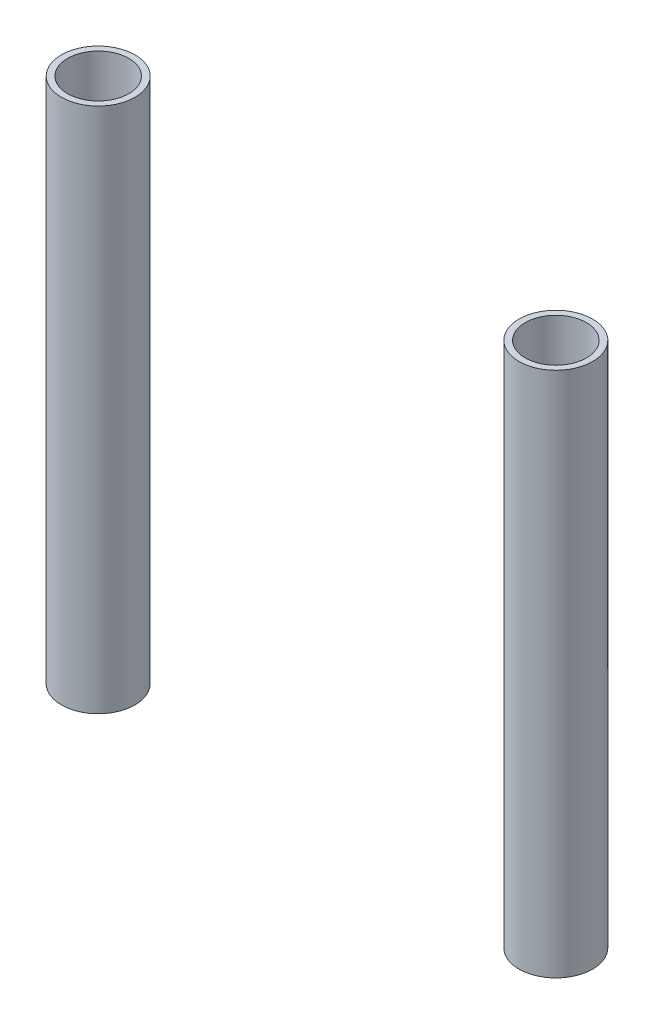
ISO-10303-21;
HEADER;
FILE_DESCRIPTION(('STEP AP214'),'2;1');
FILE_NAME('part.step','',(''),(''),'','','');
FILE_SCHEMA(('AUTOMOTIVE_DESIGN { 1 0 10303 214 1 1 1 1 }'));
ENDSEC;
DATA;
#1=APPLICATION_CONTEXT('core data for automotive mechanical design processes');
#2=APPLICATION_PROTOCOL_DEFINITION('international standard','automotive_design',2000,#1);
#3=PRODUCT_CONTEXT('',#1,'mechanical');
#4=PRODUCT('Part','Part','',(#3));
#5=PRODUCT_RELATED_PRODUCT_CATEGORY('part','',(#4));
#6=PRODUCT_DEFINITION_FORMATION('','',#4);
#7=PRODUCT_DEFINITION_CONTEXT('part definition',#1,'design');
#8=PRODUCT_DEFINITION('design','',#6,#7);
#9=PRODUCT_DEFINITION_SHAPE('','',#8);
#10=(LENGTH_UNIT() NAMED_UNIT(*) SI_UNIT(.MILLI.,.METRE.));
#11=(NAMED_UNIT(*) PLANE_ANGLE_UNIT() SI_UNIT($,.RADIAN.));
#12=(NAMED_UNIT(*) SI_UNIT($,.STERADIAN.) SOLID_ANGLE_UNIT());
#13=UNCERTAINTY_MEASURE_WITH_UNIT(LENGTH_MEASURE(1.E-05),#10,'distance_accuracy_value','');
#14=(GEOMETRIC_REPRESENTATION_CONTEXT(3) GLOBAL_UNCERTAINTY_ASSIGNED_CONTEXT((#13)) GLOBAL_UNIT_ASSIGNED_CONTEXT((#10,
#11,#12)) REPRESENTATION_CONTEXT('',''));
#15=CARTESIAN_POINT('',(0.,0.,0.));
#16=DIRECTION('',(0.,0.,1.));
#17=DIRECTION('',(1.,0.,0.));
#18=AXIS2_PLACEMENT_3D('',#15,#16,#17);
#19=CARTESIAN_POINT('',(50.,115.,0.));
#20=DIRECTION('',(0.,-1.,0.));
#21=DIRECTION('',(0.,0.,-1.));
#22=AXIS2_PLACEMENT_3D('',#19,#20,#21);
#23=PLANE('',#22);
#24=CARTESIAN_POINT('',(50.,115.,0.));
#25=DIRECTION('',(0.,1.,0.));
#26=DIRECTION('',(0.,0.,-1.));
#27=AXIS2_PLACEMENT_3D('',#24,#25,#26);
#28=CIRCLE('',#27,8.03897815940427);
#29=CARTESIAN_POINT('',(50.,115.,-8.03897815940426));
#30=VERTEX_POINT('',#29);
#31=EDGE_CURVE('E11',#30,#30,#28,.T.);
#32=ORIENTED_EDGE('',*,*,#31,.T.);
#33=EDGE_LOOP('',(#32));
#34=FACE_BOUND('',#33,.T.);
#35=CARTESIAN_POINT('',(50.,115.,0.));
#36=DIRECTION('',(0.,1.,0.));
#37=DIRECTION('',(0.,0.,-1.));
#38=AXIS2_PLACEMENT_3D('',#35,#36,#37);
#39=CIRCLE('',#38,6.69277815940427);
#40=CARTESIAN_POINT('',(50.,115.,-6.69277815940426));
#41=VERTEX_POINT('',#40);
#42=EDGE_CURVE('E50',#41,#41,#39,.T.);
#43=ORIENTED_EDGE('',*,*,#42,.F.);
#44=EDGE_LOOP('',(#43));
#45=FACE_BOUND('',#44,.T.);
#46=ADVANCED_FACE('F39',(#34,#45),#23,.F.);
#47=CARTESIAN_POINT('',(50.,0.,0.));
#48=DIRECTION('',(0.,-1.,0.));
#49=DIRECTION('',(0.,0.,-1.));
#50=AXIS2_PLACEMENT_3D('',#47,#48,#49);
#51=PLANE('',#50);
#52=CARTESIAN_POINT('',(50.,0.,0.));
#53=DIRECTION('',(0.,1.,0.));
#54=DIRECTION('',(0.,0.,-1.));
#55=AXIS2_PLACEMENT_3D('',#52,#53,#54);
#56=CIRCLE('',#55,8.03897815940427);
#57=CARTESIAN_POINT('',(50.,0.,-8.03897815940426));
#58=VERTEX_POINT('',#57);
#59=EDGE_CURVE('E43',#58,#58,#56,.T.);
#60=ORIENTED_EDGE('',*,*,#59,.F.);
#61=EDGE_LOOP('',(#60));
#62=FACE_BOUND('',#61,.T.);
#63=CARTESIAN_POINT('',(50.,0.,0.));
#64=DIRECTION('',(0.,1.,0.));
#65=DIRECTION('',(0.,0.,-1.));
#66=AXIS2_PLACEMENT_3D('',#63,#64,#65);
#67=CIRCLE('',#66,6.69277815940427);
#68=CARTESIAN_POINT('',(50.,0.,-6.69277815940426));
#69=VERTEX_POINT('',#68);
#70=EDGE_CURVE('E52',#69,#69,#67,.T.);
#71=ORIENTED_EDGE('',*,*,#70,.T.);
#72=EDGE_LOOP('',(#71));
#73=FACE_BOUND('',#72,.T.);
#74=ADVANCED_FACE('F62',(#62,#73),#51,.T.);
#75=CARTESIAN_POINT('',(50.,115.,0.));
#76=DIRECTION('',(0.,-1.,0.));
#77=DIRECTION('',(0.,0.,-1.));
#78=AXIS2_PLACEMENT_3D('',#75,#76,#77);
#79=CYLINDRICAL_SURFACE('',#78,8.03897815940427);
#80=ORIENTED_EDGE('',*,*,#31,.F.);
#81=EDGE_LOOP('',(#80));
#82=FACE_BOUND('',#81,.T.);
#83=ORIENTED_EDGE('',*,*,#59,.T.);
#84=EDGE_LOOP('',(#83));
#85=FACE_BOUND('',#84,.T.);
#86=ADVANCED_FACE('F41',(#82,#85),#79,.T.);
#87=CARTESIAN_POINT('',(50.,115.,0.));
#88=DIRECTION('',(0.,-1.,0.));
#89=DIRECTION('',(0.,0.,-1.));
#90=AXIS2_PLACEMENT_3D('',#87,#88,#89);
#91=CYLINDRICAL_SURFACE('',#90,6.69277815940427);
#92=ORIENTED_EDGE('',*,*,#42,.T.);
#93=EDGE_LOOP('',(#92));
#94=FACE_BOUND('',#93,.T.);
#95=ORIENTED_EDGE('',*,*,#70,.F.);
#96=EDGE_LOOP('',(#95));
#97=FACE_BOUND('',#96,.T.);
#98=ADVANCED_FACE('F58',(#94,#97),#91,.F.);
#99=CLOSED_SHELL('',(#46,#74,#86,#98));
#100=MANIFOLD_SOLID_BREP('B2',#99);
#101=CARTESIAN_POINT('',(-50.,115.,0.));
#102=DIRECTION('',(0.,1.,0.));
#103=DIRECTION('',(0.,0.,1.));
#104=AXIS2_PLACEMENT_3D('',#101,#102,#103);
#105=PLANE('',#104);
#106=CARTESIAN_POINT('',(-50.,115.,0.));
#107=DIRECTION('',(0.,1.,0.));
#108=DIRECTION('',(0.,0.,1.));
#109=AXIS2_PLACEMENT_3D('',#106,#107,#108);
#110=CIRCLE('',#109,8.03897815940428);
#111=CARTESIAN_POINT('',(-50.,115.,8.03897815940429));
#112=VERTEX_POINT('',#111);
#113=EDGE_CURVE('E38',#112,#112,#110,.T.);
#114=ORIENTED_EDGE('',*,*,#113,.T.);
#115=EDGE_LOOP('',(#114));
#116=FACE_BOUND('',#115,.T.);
#117=CARTESIAN_POINT('',(-50.,115.,0.));
#118=DIRECTION('',(0.,1.,0.));
#119=DIRECTION('',(0.,0.,1.));
#120=AXIS2_PLACEMENT_3D('',#117,#118,#119);
#121=CIRCLE('',#120,6.69277815940428);
#122=CARTESIAN_POINT('',(-50.,115.,6.69277815940429));
#123=VERTEX_POINT('',#122);
#124=EDGE_CURVE('E112',#123,#123,#121,.T.);
#125=ORIENTED_EDGE('',*,*,#124,.F.);
#126=EDGE_LOOP('',(#125));
#127=FACE_BOUND('',#126,.T.);
#128=ADVANCED_FACE('F101',(#116,#127),#105,.T.);
#129=CARTESIAN_POINT('',(-50.,0.,0.));
#130=DIRECTION('',(0.,1.,0.));
#131=DIRECTION('',(0.,0.,1.));
#132=AXIS2_PLACEMENT_3D('',#129,#130,#131);
#133=PLANE('',#132);
#134=CARTESIAN_POINT('',(-50.,0.,0.));
#135=DIRECTION('',(0.,1.,0.));
#136=DIRECTION('',(0.,0.,1.));
#137=AXIS2_PLACEMENT_3D('',#134,#135,#136);
#138=CIRCLE('',#137,8.03897815940428);
#139=CARTESIAN_POINT('',(-50.,0.,8.03897815940429));
#140=VERTEX_POINT('',#139);
#141=EDGE_CURVE('E105',#140,#140,#138,.T.);
#142=ORIENTED_EDGE('',*,*,#141,.F.);
#143=EDGE_LOOP('',(#142));
#144=FACE_BOUND('',#143,.T.);
#145=CARTESIAN_POINT('',(-50.,0.,0.));
#146=DIRECTION('',(0.,1.,0.));
#147=DIRECTION('',(0.,0.,1.));
#148=AXIS2_PLACEMENT_3D('',#145,#146,#147);
#149=CIRCLE('',#148,6.69277815940428);
#150=CARTESIAN_POINT('',(-50.,0.,6.69277815940429));
#151=VERTEX_POINT('',#150);
#152=EDGE_CURVE('E114',#151,#151,#149,.T.);
#153=ORIENTED_EDGE('',*,*,#152,.T.);
#154=EDGE_LOOP('',(#153));
#155=FACE_BOUND('',#154,.T.);
#156=ADVANCED_FACE('F124',(#144,#155),#133,.F.);
#157=CARTESIAN_POINT('',(-50.,115.,0.));
#158=DIRECTION('',(0.,-1.,0.));
#159=DIRECTION('',(0.,0.,-1.));
#160=AXIS2_PLACEMENT_3D('',#157,#158,#159);
#161=CYLINDRICAL_SURFACE('',#160,8.03897815940428);
#162=ORIENTED_EDGE('',*,*,#113,.F.);
#163=EDGE_LOOP('',(#162));
#164=FACE_BOUND('',#163,.T.);
#165=ORIENTED_EDGE('',*,*,#141,.T.);
#166=EDGE_LOOP('',(#165));
#167=FACE_BOUND('',#166,.T.);
#168=ADVANCED_FACE('F103',(#164,#167),#161,.T.);
#169=CARTESIAN_POINT('',(-50.,115.,0.));
#170=DIRECTION('',(0.,-1.,0.));
#171=DIRECTION('',(0.,0.,-1.));
#172=AXIS2_PLACEMENT_3D('',#169,#170,#171);
#173=CYLINDRICAL_SURFACE('',#172,6.69277815940428);
#174=ORIENTED_EDGE('',*,*,#124,.T.);
#175=EDGE_LOOP('',(#174));
#176=FACE_BOUND('',#175,.T.);
#177=ORIENTED_EDGE('',*,*,#152,.F.);
#178=EDGE_LOOP('',(#177));
#179=FACE_BOUND('',#178,.T.);
#180=ADVANCED_FACE('F120',(#176,#179),#173,.F.);
#181=CLOSED_SHELL('',(#128,#156,#168,#180));
#182=MANIFOLD_SOLID_BREP('B6',#181);
#183=ADVANCED_BREP_SHAPE_REPRESENTATION('',(#18,#100,#182),#14);
#184=SHAPE_DEFINITION_REPRESENTATION(#9,#183);
ENDSEC;
END-ISO-10303-21;
